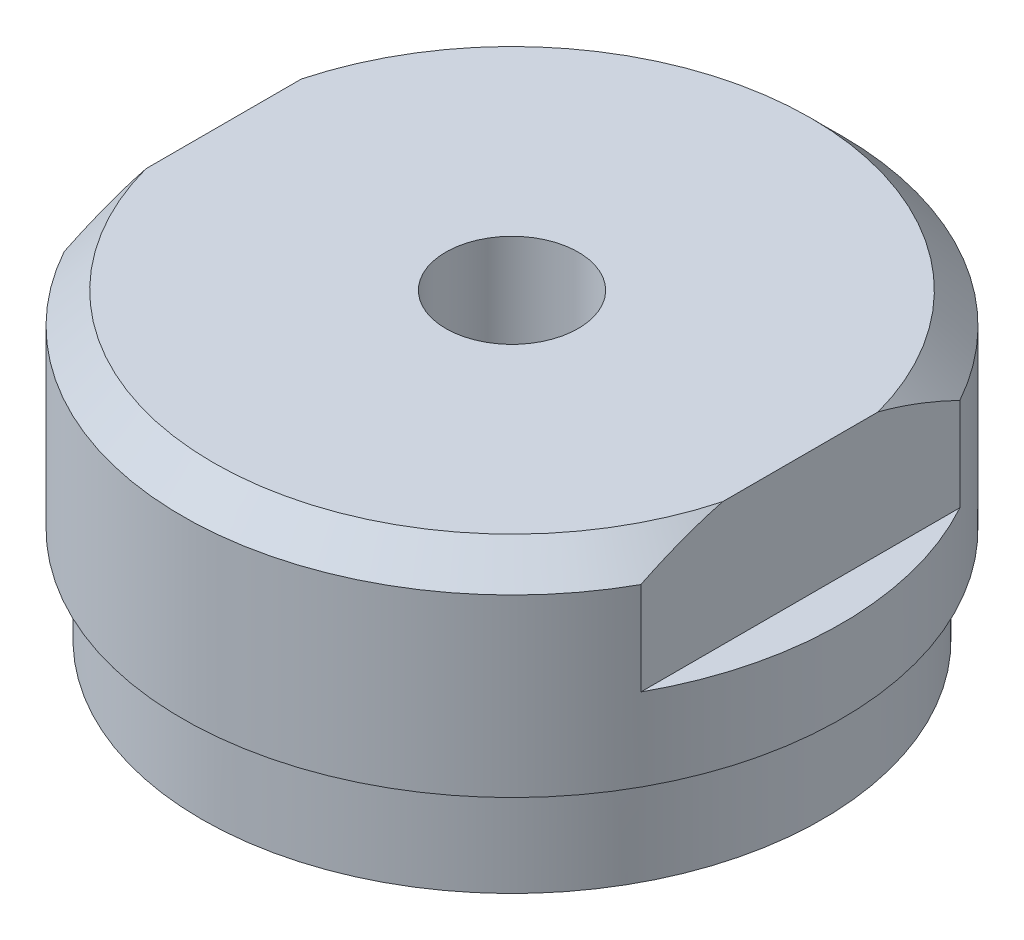
ISO-10303-21;
HEADER;
FILE_DESCRIPTION(('STEP AP214'),'2;1');
FILE_NAME('part.step','',(''),(''),'','','');
FILE_SCHEMA(('AUTOMOTIVE_DESIGN { 1 0 10303 214 1 1 1 1 }'));
ENDSEC;
DATA;
#1=APPLICATION_CONTEXT('core data for automotive mechanical design processes');
#2=APPLICATION_PROTOCOL_DEFINITION('international standard','automotive_design',2000,#1);
#3=PRODUCT_CONTEXT('',#1,'mechanical');
#4=PRODUCT('Part','Part','',(#3));
#5=PRODUCT_RELATED_PRODUCT_CATEGORY('part','',(#4));
#6=PRODUCT_DEFINITION_FORMATION('','',#4);
#7=PRODUCT_DEFINITION_CONTEXT('part definition',#1,'design');
#8=PRODUCT_DEFINITION('design','',#6,#7);
#9=PRODUCT_DEFINITION_SHAPE('','',#8);
#10=(LENGTH_UNIT() NAMED_UNIT(*) SI_UNIT(.MILLI.,.METRE.));
#11=(NAMED_UNIT(*) PLANE_ANGLE_UNIT() SI_UNIT($,.RADIAN.));
#12=(NAMED_UNIT(*) SI_UNIT($,.STERADIAN.) SOLID_ANGLE_UNIT());
#13=UNCERTAINTY_MEASURE_WITH_UNIT(LENGTH_MEASURE(1.E-05),#10,'distance_accuracy_value','');
#14=(GEOMETRIC_REPRESENTATION_CONTEXT(3) GLOBAL_UNCERTAINTY_ASSIGNED_CONTEXT((#13)) GLOBAL_UNIT_ASSIGNED_CONTEXT((#10,
#11,#12)) REPRESENTATION_CONTEXT('',''));
#15=CARTESIAN_POINT('',(0.,0.,0.));
#16=DIRECTION('',(0.,0.,1.));
#17=DIRECTION('',(1.,0.,0.));
#18=AXIS2_PLACEMENT_3D('',#15,#16,#17);
#19=CARTESIAN_POINT('',(0.,0.,0.));
#20=DIRECTION('',(0.,-1.,0.));
#21=DIRECTION('',(0.,0.,-1.));
#22=AXIS2_PLACEMENT_3D('',#19,#20,#21);
#23=PLANE('',#22);
#24=CARTESIAN_POINT('',(0.,0.,0.));
#25=DIRECTION('',(0.,1.,0.));
#26=DIRECTION('',(0.,0.,1.));
#27=AXIS2_PLACEMENT_3D('',#24,#25,#26);
#28=CIRCLE('',#27,10.1854);
#29=CARTESIAN_POINT('',(0.,0.,10.1854));
#30=VERTEX_POINT('',#29);
#31=EDGE_CURVE('E20',#30,#30,#28,.T.);
#32=ORIENTED_EDGE('',*,*,#31,.F.);
#33=EDGE_LOOP('',(#32));
#34=FACE_BOUND('',#33,.T.);
#35=ADVANCED_FACE('F17',(#34),#23,.T.);
#36=CARTESIAN_POINT('',(0.,1.02652877861916,0.));
#37=DIRECTION('',(0.,1.,0.));
#38=DIRECTION('',(0.,0.,1.));
#39=AXIS2_PLACEMENT_3D('',#36,#37,#38);
#40=CONICAL_SURFACE('',#39,11.9634,1.0471975511966);
#41=ORIENTED_EDGE('',*,*,#31,.T.);
#42=EDGE_LOOP('',(#41));
#43=FACE_BOUND('',#42,.T.);
#44=CARTESIAN_POINT('',(0.,1.02652877861916,0.));
#45=DIRECTION('',(0.,-1.,0.));
#46=DIRECTION('',(0.,0.,-1.));
#47=AXIS2_PLACEMENT_3D('',#44,#45,#46);
#48=CIRCLE('',#47,11.9634);
#49=CARTESIAN_POINT('',(0.,1.02652877861916,-11.9634));
#50=VERTEX_POINT('',#49);
#51=EDGE_CURVE('E120',#50,#50,#48,.F.);
#52=ORIENTED_EDGE('',*,*,#51,.F.);
#53=EDGE_LOOP('',(#52));
#54=FACE_BOUND('',#53,.T.);
#55=ADVANCED_FACE('F181',(#43,#54),#40,.T.);
#56=CARTESIAN_POINT('',(0.,0.,0.));
#57=DIRECTION('',(0.,-1.,0.));
#58=DIRECTION('',(0.,0.,-1.));
#59=AXIS2_PLACEMENT_3D('',#56,#57,#58);
#60=CYLINDRICAL_SURFACE('',#59,11.9634);
#61=CARTESIAN_POINT('',(0.,4.7498,0.));
#62=DIRECTION('',(0.,-1.,0.));
#63=DIRECTION('',(0.,0.,-1.));
#64=AXIS2_PLACEMENT_3D('',#61,#62,#63);
#65=CIRCLE('',#64,11.9634);
#66=CARTESIAN_POINT('',(0.,4.7498,-11.9634));
#67=VERTEX_POINT('',#66);
#68=EDGE_CURVE('E84',#67,#67,#65,.F.);
#69=ORIENTED_EDGE('',*,*,#68,.F.);
#70=EDGE_LOOP('',(#69));
#71=FACE_BOUND('',#70,.T.);
#72=ORIENTED_EDGE('',*,*,#51,.T.);
#73=EDGE_LOOP('',(#72));
#74=FACE_BOUND('',#73,.T.);
#75=ADVANCED_FACE('F174',(#71,#74),#60,.T.);
#76=CARTESIAN_POINT('',(11.9634,4.7498,0.));
#77=DIRECTION('',(0.,-1.,0.));
#78=DIRECTION('',(0.,0.,-1.));
#79=AXIS2_PLACEMENT_3D('',#76,#77,#78);
#80=PLANE('',#79);
#81=ORIENTED_EDGE('',*,*,#68,.T.);
#82=EDGE_LOOP('',(#81));
#83=FACE_BOUND('',#82,.T.);
#84=CARTESIAN_POINT('',(0.,4.7498,0.));
#85=DIRECTION('',(0.,-1.,0.));
#86=DIRECTION('',(0.,0.,-1.));
#87=AXIS2_PLACEMENT_3D('',#84,#85,#86);
#88=CIRCLE('',#87,12.7);
#89=CARTESIAN_POINT('',(0.,4.7498,-12.7));
#90=VERTEX_POINT('',#89);
#91=EDGE_CURVE('E83',#90,#90,#88,.F.);
#92=ORIENTED_EDGE('',*,*,#91,.F.);
#93=EDGE_LOOP('',(#92));
#94=FACE_BOUND('',#93,.T.);
#95=ADVANCED_FACE('F165',(#83,#94),#80,.T.);
#96=CARTESIAN_POINT('',(0.,1.57479999995758,0.));
#97=DIRECTION('',(0.,1.,0.));
#98=DIRECTION('',(0.,0.,1.));
#99=AXIS2_PLACEMENT_3D('',#96,#97,#98);
#100=CONICAL_SURFACE('',#99,2.55269999996699,1.02974425866154);
#101=CARTESIAN_POINT('',(0.,0.0409830977332604,0.));
#102=VERTEX_POINT('',#101);
#103=VERTEX_LOOP('',#102);
#104=FACE_BOUND('',#103,.T.);
#105=CARTESIAN_POINT('',(0.,1.5748,0.));
#106=DIRECTION('',(0.,1.,0.));
#107=DIRECTION('',(0.,0.,1.));
#108=AXIS2_PLACEMENT_3D('',#105,#106,#107);
#109=CIRCLE('',#108,2.5527);
#110=CARTESIAN_POINT('',(0.,1.5748,2.5527));
#111=VERTEX_POINT('',#110);
#112=EDGE_CURVE('E116',#111,#111,#109,.T.);
#113=ORIENTED_EDGE('',*,*,#112,.T.);
#114=EDGE_LOOP('',(#113));
#115=FACE_BOUND('',#114,.T.);
#116=ADVANCED_FACE('F162',(#104,#115),#100,.F.);
#117=CARTESIAN_POINT('',(0.,7.9248,0.));
#118=DIRECTION('',(0.,1.,0.));
#119=DIRECTION('',(0.,0.,1.));
#120=AXIS2_PLACEMENT_3D('',#117,#118,#119);
#121=PLANE('',#120);
#122=CARTESIAN_POINT('',(0.,7.9248,0.));
#123=DIRECTION('',(0.,-1.,0.));
#124=DIRECTION('',(0.,0.,-1.));
#125=AXIS2_PLACEMENT_3D('',#122,#123,#124);
#126=CIRCLE('',#125,12.7);
#127=CARTESIAN_POINT('',(11.1125,7.9248,-6.14836106210427));
#128=VERTEX_POINT('',#127);
#129=CARTESIAN_POINT('',(11.1125,7.9248,6.14836106210427));
#130=VERTEX_POINT('',#129);
#131=EDGE_CURVE('E119',#128,#130,#126,.T.);
#132=ORIENTED_EDGE('',*,*,#131,.F.);
#133=DIRECTION('',(0.,0.,1.));
#134=VECTOR('',#133,1.);
#135=CARTESIAN_POINT('',(11.1125,7.9248,-6.14836106210428));
#136=LINE('',#135,#134);
#137=EDGE_CURVE('E105',#128,#130,#136,.T.);
#138=ORIENTED_EDGE('',*,*,#137,.T.);
#139=EDGE_LOOP('',(#132,#138));
#140=FACE_BOUND('',#139,.T.);
#141=ADVANCED_FACE('F164',(#140),#121,.T.);
#142=CARTESIAN_POINT('',(0.,7.9248,0.));
#143=DIRECTION('',(0.,1.,0.));
#144=DIRECTION('',(0.,0.,1.));
#145=AXIS2_PLACEMENT_3D('',#142,#143,#144);
#146=PLANE('',#145);
#147=CARTESIAN_POINT('',(0.,7.9248,0.));
#148=DIRECTION('',(0.,-1.,0.));
#149=DIRECTION('',(0.,0.,-1.));
#150=AXIS2_PLACEMENT_3D('',#147,#148,#149);
#151=CIRCLE('',#150,12.7);
#152=CARTESIAN_POINT('',(-11.1125,7.9248,6.14836106210428));
#153=VERTEX_POINT('',#152);
#154=CARTESIAN_POINT('',(-11.1125,7.9248,-6.14836106210428));
#155=VERTEX_POINT('',#154);
#156=EDGE_CURVE('E70',#153,#155,#151,.T.);
#157=ORIENTED_EDGE('',*,*,#156,.F.);
#158=DIRECTION('',(0.,0.,-1.));
#159=VECTOR('',#158,1.);
#160=CARTESIAN_POINT('',(-11.1125,7.9248,6.14836106210428));
#161=LINE('',#160,#159);
#162=EDGE_CURVE('E73',#153,#155,#161,.T.);
#163=ORIENTED_EDGE('',*,*,#162,.T.);
#164=EDGE_LOOP('',(#157,#163));
#165=FACE_BOUND('',#164,.T.);
#166=ADVANCED_FACE('F74',(#165),#146,.T.);
#167=CARTESIAN_POINT('',(0.,0.,0.));
#168=DIRECTION('',(0.,-1.,0.));
#169=DIRECTION('',(0.,0.,-1.));
#170=AXIS2_PLACEMENT_3D('',#167,#168,#169);
#171=CYLINDRICAL_SURFACE('',#170,12.7);
#172=ORIENTED_EDGE('',*,*,#91,.T.);
#173=EDGE_LOOP('',(#172));
#174=FACE_BOUND('',#173,.T.);
#175=ORIENTED_EDGE('',*,*,#131,.T.);
#176=DIRECTION('',(0.,1.,0.));
#177=VECTOR('',#176,1.);
#178=CARTESIAN_POINT('',(11.1125,7.9248,6.14836106210428));
#179=LINE('',#178,#177);
#180=CARTESIAN_POINT('',(11.1125,11.509375,6.14836106210428));
#181=VERTEX_POINT('',#180);
#182=EDGE_CURVE('E103',#130,#181,#179,.T.);
#183=ORIENTED_EDGE('',*,*,#182,.T.);
#184=CARTESIAN_POINT('',(0.,11.509375,0.));
#185=DIRECTION('',(0.,-1.,0.));
#186=DIRECTION('',(0.,0.,-1.));
#187=AXIS2_PLACEMENT_3D('',#184,#185,#186);
#188=CIRCLE('',#187,12.7);
#189=CARTESIAN_POINT('',(-11.1125,11.509375,6.14836106210428));
#190=VERTEX_POINT('',#189);
#191=EDGE_CURVE('E106',#190,#181,#188,.F.);
#192=ORIENTED_EDGE('',*,*,#191,.F.);
#193=DIRECTION('',(0.,1.,0.));
#194=VECTOR('',#193,1.);
#195=CARTESIAN_POINT('',(-11.1125,7.9248,6.14836106210428));
#196=LINE('',#195,#194);
#197=EDGE_CURVE('E77',#190,#153,#196,.F.);
#198=ORIENTED_EDGE('',*,*,#197,.T.);
#199=ORIENTED_EDGE('',*,*,#156,.T.);
#200=DIRECTION('',(0.,1.,0.));
#201=VECTOR('',#200,1.);
#202=CARTESIAN_POINT('',(-11.1125,7.9248,-6.14836106210428));
#203=LINE('',#202,#201);
#204=CARTESIAN_POINT('',(-11.1125,11.509375,-6.14836106210428));
#205=VERTEX_POINT('',#204);
#206=EDGE_CURVE('E76',#155,#205,#203,.T.);
#207=ORIENTED_EDGE('',*,*,#206,.T.);
#208=CARTESIAN_POINT('',(0.,11.509375,0.));
#209=DIRECTION('',(0.,-1.,0.));
#210=DIRECTION('',(0.,0.,-1.));
#211=AXIS2_PLACEMENT_3D('',#208,#209,#210);
#212=CIRCLE('',#211,12.7);
#213=CARTESIAN_POINT('',(11.1125,11.509375,-6.14836106210428));
#214=VERTEX_POINT('',#213);
#215=EDGE_CURVE('E98',#214,#205,#212,.F.);
#216=ORIENTED_EDGE('',*,*,#215,.F.);
#217=DIRECTION('',(0.,1.,0.));
#218=VECTOR('',#217,1.);
#219=CARTESIAN_POINT('',(11.1125,7.9248,-6.14836106210428));
#220=LINE('',#219,#218);
#221=EDGE_CURVE('E99',#214,#128,#220,.F.);
#222=ORIENTED_EDGE('',*,*,#221,.T.);
#223=EDGE_LOOP('',(#175,#183,#192,#198,#199,#207,#216,#222));
#224=FACE_BOUND('',#223,.T.);
#225=ADVANCED_FACE('F81',(#174,#224),#171,.T.);
#226=CARTESIAN_POINT('',(0.,12.7,0.));
#227=DIRECTION('',(0.,1.,0.));
#228=DIRECTION('',(0.,0.,1.));
#229=AXIS2_PLACEMENT_3D('',#226,#227,#228);
#230=CYLINDRICAL_SURFACE('',#229,2.5527);
#231=CARTESIAN_POINT('',(0.,12.7,0.));
#232=DIRECTION('',(0.,1.,0.));
#233=DIRECTION('',(0.,0.,1.));
#234=AXIS2_PLACEMENT_3D('',#231,#232,#233);
#235=CIRCLE('',#234,2.5527);
#236=CARTESIAN_POINT('',(0.,12.7,2.5527));
#237=VERTEX_POINT('',#236);
#238=EDGE_CURVE('E109',#237,#237,#235,.F.);
#239=ORIENTED_EDGE('',*,*,#238,.F.);
#240=EDGE_LOOP('',(#239));
#241=FACE_BOUND('',#240,.T.);
#242=ORIENTED_EDGE('',*,*,#112,.F.);
#243=EDGE_LOOP('',(#242));
#244=FACE_BOUND('',#243,.T.);
#245=ADVANCED_FACE('F155',(#241,#244),#230,.F.);
#246=CARTESIAN_POINT('',(11.1125,7.9248,-6.14836106210428));
#247=DIRECTION('',(-1.,0.,0.));
#248=DIRECTION('',(0.,0.,1.));
#249=AXIS2_PLACEMENT_3D('',#246,#247,#248);
#250=PLANE('',#249);
#251=CARTESIAN_POINT('',(11.1125,12.7,-2.99634054149809));
#252=CARTESIAN_POINT('',(11.1125,12.6290353248975,-3.26895204006974));
#253=CARTESIAN_POINT('',(11.1125,12.5496296222091,-3.53924885936605));
#254=CARTESIAN_POINT('',(11.1125,12.3761773209373,-4.07440657411811));
#255=CARTESIAN_POINT('',(11.1125,12.2821662281826,-4.33927893415953));
#256=CARTESIAN_POINT('',(11.1125,12.0814243298071,-4.8639851998399));
#257=CARTESIAN_POINT('',(11.1125,11.9746985215379,-5.12382103863496));
#258=CARTESIAN_POINT('',(11.1125,11.7499990871222,-5.63933824886578));
#259=CARTESIAN_POINT('',(11.1125,11.6319990945819,-5.89500815978218));
#260=CARTESIAN_POINT('',(11.1125,11.509375,-6.14836106210428));
#261=B_SPLINE_CURVE_WITH_KNOTS('',3,(#251,#252,#253,#254,#255,#256,#257,#258,#259,#260),
.UNSPECIFIED.,.F.,.F.,(4,2,2,2,4),(0.,0.844791949649482,1.68756144312847,2.53000078322125,
3.37446090829707),.UNSPECIFIED.);
#262=CARTESIAN_POINT('',(11.1125,12.7,-2.99634054149809));
#263=VERTEX_POINT('',#262);
#264=EDGE_CURVE('E102',#263,#214,#261,.T.);
#265=ORIENTED_EDGE('',*,*,#264,.F.);
#266=DIRECTION('',(0.,0.,1.));
#267=VECTOR('',#266,1.);
#268=CARTESIAN_POINT('',(11.1125,12.7,0.));
#269=LINE('',#268,#267);
#270=CARTESIAN_POINT('',(11.1125,12.7,2.99634054149808));
#271=VERTEX_POINT('',#270);
#272=EDGE_CURVE('E95',#271,#263,#269,.F.);
#273=ORIENTED_EDGE('',*,*,#272,.F.);
#274=CARTESIAN_POINT('',(11.1125,11.509375,6.14836106210428));
#275=CARTESIAN_POINT('',(11.1125,11.6319990945819,5.89500815978218));
#276=CARTESIAN_POINT('',(11.1125,11.7499990871222,5.63933824886578));
#277=CARTESIAN_POINT('',(11.1125,11.9746985215379,5.12382103863495));
#278=CARTESIAN_POINT('',(11.1125,12.0814243298071,4.8639851998399));
#279=CARTESIAN_POINT('',(11.1125,12.2821662281826,4.33927893415952));
#280=CARTESIAN_POINT('',(11.1125,12.3761773209373,4.0744065741181));
#281=CARTESIAN_POINT('',(11.1125,12.5496296222091,3.53924885936604));
#282=CARTESIAN_POINT('',(11.1125,12.6290353248975,3.26895204006974));
#283=CARTESIAN_POINT('',(11.1125,12.7,2.99634054149809));
#284=B_SPLINE_CURVE_WITH_KNOTS('',3,(#274,#275,#276,#277,#278,#279,#280,#281,#282,#283),
.UNSPECIFIED.,.F.,.F.,(4,2,2,2,4),(0.,0.844460125075828,1.68689946516861,2.52966895864759,
3.37446090829707),.UNSPECIFIED.);
#285=EDGE_CURVE('E91',#181,#271,#284,.T.);
#286=ORIENTED_EDGE('',*,*,#285,.F.);
#287=ORIENTED_EDGE('',*,*,#182,.F.);
#288=ORIENTED_EDGE('',*,*,#137,.F.);
#289=ORIENTED_EDGE('',*,*,#221,.F.);
#290=EDGE_LOOP('',(#265,#273,#286,#287,#288,#289));
#291=FACE_BOUND('',#290,.T.);
#292=ADVANCED_FACE('F158',(#291),#250,.F.);
#293=CARTESIAN_POINT('',(0.,11.509375,0.));
#294=DIRECTION('',(0.,-1.,0.));
#295=DIRECTION('',(0.,0.,-1.));
#296=AXIS2_PLACEMENT_3D('',#293,#294,#295);
#297=CONICAL_SURFACE('',#296,12.7,0.78539816339745);
#298=ORIENTED_EDGE('',*,*,#215,.T.);
#299=CARTESIAN_POINT('',(-11.1125,11.509375,-6.14836106210428));
#300=CARTESIAN_POINT('',(-11.1125,11.6319990945819,-5.89500815978218));
#301=CARTESIAN_POINT('',(-11.1125,11.7499990871222,-5.63933824886578));
#302=CARTESIAN_POINT('',(-11.1125,11.9746985215379,-5.12382103863496));
#303=CARTESIAN_POINT('',(-11.1125,12.0814243298071,-4.8639851998399));
#304=CARTESIAN_POINT('',(-11.1125,12.2821662281826,-4.33927893415953));
#305=CARTESIAN_POINT('',(-11.1125,12.3761773209373,-4.07440657411811));
#306=CARTESIAN_POINT('',(-11.1125,12.5496296222091,-3.53924885936605));
#307=CARTESIAN_POINT('',(-11.1125,12.6290353248975,-3.26895204006975));
#308=CARTESIAN_POINT('',(-11.1125,12.7,-2.9963405414981));
#309=B_SPLINE_CURVE_WITH_KNOTS('',3,(#299,#300,#301,#302,#303,#304,#305,#306,#307,#308),
.UNSPECIFIED.,.F.,.F.,(4,2,2,2,4),(0.,0.844460125075825,1.6868994651686,2.52966895864758,
3.37446090829706),.UNSPECIFIED.);
#310=CARTESIAN_POINT('',(-11.1125,12.7,-2.9963405414981));
#311=VERTEX_POINT('',#310);
#312=EDGE_CURVE('E89',#205,#311,#309,.T.);
#313=ORIENTED_EDGE('',*,*,#312,.T.);
#314=CARTESIAN_POINT('',(0.,12.7,0.));
#315=DIRECTION('',(0.,-1.,0.));
#316=DIRECTION('',(0.,0.,-1.));
#317=AXIS2_PLACEMENT_3D('',#314,#315,#316);
#318=CIRCLE('',#317,11.509375);
#319=EDGE_CURVE('E123',#263,#311,#318,.F.);
#320=ORIENTED_EDGE('',*,*,#319,.F.);
#321=ORIENTED_EDGE('',*,*,#264,.T.);
#322=EDGE_LOOP('',(#298,#313,#320,#321));
#323=FACE_BOUND('',#322,.T.);
#324=ADVANCED_FACE('F259',(#323),#297,.T.);
#325=CARTESIAN_POINT('',(-11.1125,7.9248,6.14836106210428));
#326=DIRECTION('',(1.,0.,0.));
#327=DIRECTION('',(0.,0.,-1.));
#328=AXIS2_PLACEMENT_3D('',#325,#326,#327);
#329=PLANE('',#328);
#330=ORIENTED_EDGE('',*,*,#312,.F.);
#331=ORIENTED_EDGE('',*,*,#206,.F.);
#332=ORIENTED_EDGE('',*,*,#162,.F.);
#333=ORIENTED_EDGE('',*,*,#197,.F.);
#334=CARTESIAN_POINT('',(-11.1125,12.7,2.9963405414981));
#335=CARTESIAN_POINT('',(-11.1125,12.6290353248975,3.26895204006975));
#336=CARTESIAN_POINT('',(-11.1125,12.5496296222091,3.53924885936606));
#337=CARTESIAN_POINT('',(-11.1125,12.3761773209373,4.07440657411811));
#338=CARTESIAN_POINT('',(-11.1125,12.2821662281826,4.33927893415953));
#339=CARTESIAN_POINT('',(-11.1125,12.0814243298071,4.8639851998399));
#340=CARTESIAN_POINT('',(-11.1125,11.9746985215379,5.12382103863496));
#341=CARTESIAN_POINT('',(-11.1125,11.7499990871222,5.63933824886578));
#342=CARTESIAN_POINT('',(-11.1125,11.6319990945819,5.89500815978218));
#343=CARTESIAN_POINT('',(-11.1125,11.509375,6.14836106210428));
#344=B_SPLINE_CURVE_WITH_KNOTS('',3,(#334,#335,#336,#337,#338,#339,#340,#341,#342,#343),
.UNSPECIFIED.,.F.,.F.,(4,2,2,2,4),(0.,0.844791949649479,1.68756144312846,2.53000078322123,
3.37446090829706),.UNSPECIFIED.);
#345=CARTESIAN_POINT('',(-11.1125,12.7,2.9963405414981));
#346=VERTEX_POINT('',#345);
#347=EDGE_CURVE('E35',#346,#190,#344,.T.);
#348=ORIENTED_EDGE('',*,*,#347,.F.);
#349=DIRECTION('',(0.,0.,1.));
#350=VECTOR('',#349,1.);
#351=CARTESIAN_POINT('',(-11.1125,12.7,0.));
#352=LINE('',#351,#350);
#353=EDGE_CURVE('E26',#311,#346,#352,.T.);
#354=ORIENTED_EDGE('',*,*,#353,.F.);
#355=EDGE_LOOP('',(#330,#331,#332,#333,#348,#354));
#356=FACE_BOUND('',#355,.T.);
#357=ADVANCED_FACE('F87',(#356),#329,.F.);
#358=CARTESIAN_POINT('',(0.,11.509375,0.));
#359=DIRECTION('',(0.,-1.,0.));
#360=DIRECTION('',(0.,0.,-1.));
#361=AXIS2_PLACEMENT_3D('',#358,#359,#360);
#362=CONICAL_SURFACE('',#361,12.7,0.78539816339745);
#363=ORIENTED_EDGE('',*,*,#347,.T.);
#364=ORIENTED_EDGE('',*,*,#191,.T.);
#365=ORIENTED_EDGE('',*,*,#285,.T.);
#366=CARTESIAN_POINT('',(0.,12.7,0.));
#367=DIRECTION('',(0.,-1.,0.));
#368=DIRECTION('',(0.,0.,-1.));
#369=AXIS2_PLACEMENT_3D('',#366,#367,#368);
#370=CIRCLE('',#369,11.509375);
#371=EDGE_CURVE('E11',#346,#271,#370,.F.);
#372=ORIENTED_EDGE('',*,*,#371,.F.);
#373=EDGE_LOOP('',(#363,#364,#365,#372));
#374=FACE_BOUND('',#373,.T.);
#375=ADVANCED_FACE('F139',(#374),#362,.T.);
#376=CARTESIAN_POINT('',(12.7,12.7,0.));
#377=DIRECTION('',(0.,1.,0.));
#378=DIRECTION('',(0.,0.,1.));
#379=AXIS2_PLACEMENT_3D('',#376,#377,#378);
#380=PLANE('',#379);
#381=ORIENTED_EDGE('',*,*,#353,.T.);
#382=ORIENTED_EDGE('',*,*,#371,.T.);
#383=ORIENTED_EDGE('',*,*,#272,.T.);
#384=ORIENTED_EDGE('',*,*,#319,.T.);
#385=EDGE_LOOP('',(#381,#382,#383,#384));
#386=FACE_BOUND('',#385,.T.);
#387=ORIENTED_EDGE('',*,*,#238,.T.);
#388=EDGE_LOOP('',(#387));
#389=FACE_BOUND('',#388,.T.);
#390=ADVANCED_FACE('F143',(#386,#389),#380,.T.);
#391=CLOSED_SHELL('',(#35,#55,#75,#95,#116,#141,#166,#225,#245,#292,#324,#357,#375,#390));
#392=MANIFOLD_SOLID_BREP('B1',#391);
#393=ADVANCED_BREP_SHAPE_REPRESENTATION('',(#18,#392),#14);
#394=SHAPE_DEFINITION_REPRESENTATION(#9,#393);
ENDSEC;
END-ISO-10303-21;
